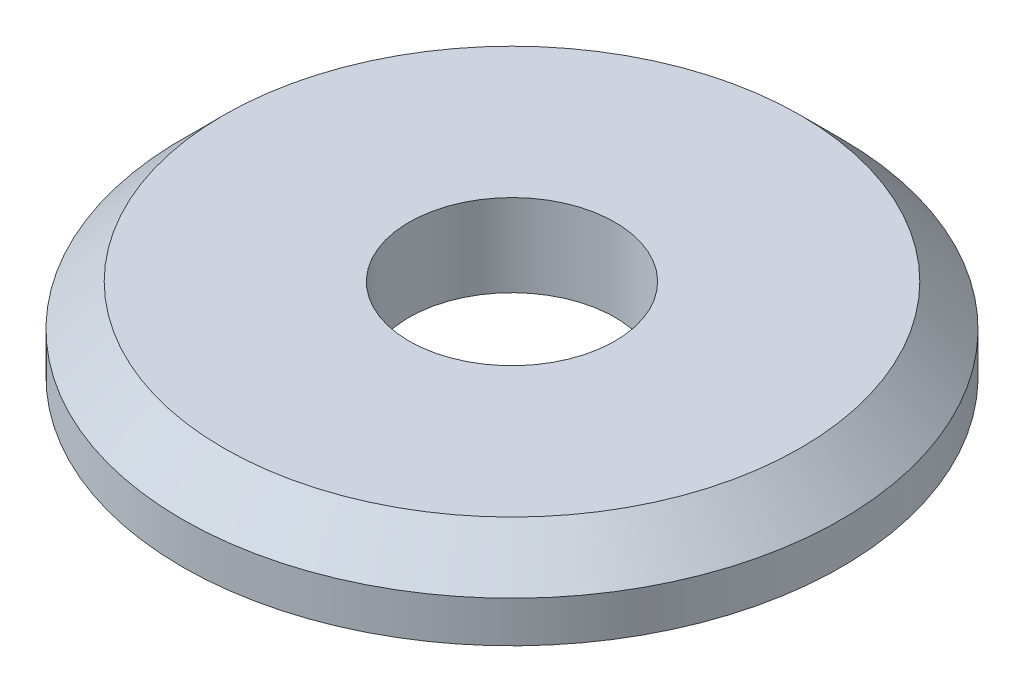
ISO-10303-21;
HEADER;
FILE_DESCRIPTION(('STEP AP214'),'2;1');
FILE_NAME('part.step','',(''),(''),'','','');
FILE_SCHEMA(('AUTOMOTIVE_DESIGN { 1 0 10303 214 1 1 1 1 }'));
ENDSEC;
DATA;
#1=APPLICATION_CONTEXT('core data for automotive mechanical design processes');
#2=APPLICATION_PROTOCOL_DEFINITION('international standard','automotive_design',2000,#1);
#3=PRODUCT_CONTEXT('',#1,'mechanical');
#4=PRODUCT('Part','Part','',(#3));
#5=PRODUCT_RELATED_PRODUCT_CATEGORY('part','',(#4));
#6=PRODUCT_DEFINITION_FORMATION('','',#4);
#7=PRODUCT_DEFINITION_CONTEXT('part definition',#1,'design');
#8=PRODUCT_DEFINITION('design','',#6,#7);
#9=PRODUCT_DEFINITION_SHAPE('','',#8);
#10=(LENGTH_UNIT() NAMED_UNIT(*) SI_UNIT(.MILLI.,.METRE.));
#11=(NAMED_UNIT(*) PLANE_ANGLE_UNIT() SI_UNIT($,.RADIAN.));
#12=(NAMED_UNIT(*) SI_UNIT($,.STERADIAN.) SOLID_ANGLE_UNIT());
#13=UNCERTAINTY_MEASURE_WITH_UNIT(LENGTH_MEASURE(1.E-05),#10,'distance_accuracy_value','');
#14=(GEOMETRIC_REPRESENTATION_CONTEXT(3) GLOBAL_UNCERTAINTY_ASSIGNED_CONTEXT((#13)) GLOBAL_UNIT_ASSIGNED_CONTEXT((#10,
#11,#12)) REPRESENTATION_CONTEXT('',''));
#15=CARTESIAN_POINT('',(0.,0.,0.));
#16=DIRECTION('',(0.,0.,1.));
#17=DIRECTION('',(1.,0.,0.));
#18=AXIS2_PLACEMENT_3D('',#15,#16,#17);
#19=CARTESIAN_POINT('',(0.,2.,0.));
#20=DIRECTION('',(0.,-1.,0.));
#21=DIRECTION('',(0.,0.,-1.));
#22=AXIS2_PLACEMENT_3D('',#19,#20,#21);
#23=CYLINDRICAL_SURFACE('',#22,8.);
#24=CARTESIAN_POINT('',(0.,0.999999999999999,0.));
#25=DIRECTION('',(0.,1.,0.));
#26=DIRECTION('',(0.,0.,1.));
#27=AXIS2_PLACEMENT_3D('',#24,#25,#26);
#28=CIRCLE('',#27,8.);
#29=CARTESIAN_POINT('',(0.,0.999999999999999,8.));
#30=VERTEX_POINT('',#29);
#31=EDGE_CURVE('E10',#30,#30,#28,.F.);
#32=ORIENTED_EDGE('',*,*,#31,.T.);
#33=EDGE_LOOP('',(#32));
#34=FACE_BOUND('',#33,.T.);
#35=CARTESIAN_POINT('',(0.,0.,0.));
#36=DIRECTION('',(0.,1.,0.));
#37=DIRECTION('',(0.,0.,1.));
#38=AXIS2_PLACEMENT_3D('',#35,#36,#37);
#39=CIRCLE('',#38,8.);
#40=CARTESIAN_POINT('',(0.,0.,8.));
#41=VERTEX_POINT('',#40);
#42=EDGE_CURVE('E43',#41,#41,#39,.T.);
#43=ORIENTED_EDGE('',*,*,#42,.T.);
#44=EDGE_LOOP('',(#43));
#45=FACE_BOUND('',#44,.T.);
#46=ADVANCED_FACE('F32',(#34,#45),#23,.T.);
#47=CARTESIAN_POINT('',(0.,2.,0.));
#48=DIRECTION('',(0.,1.,0.));
#49=DIRECTION('',(0.,0.,1.));
#50=AXIS2_PLACEMENT_3D('',#47,#48,#49);
#51=PLANE('',#50);
#52=CARTESIAN_POINT('',(0.,2.,0.));
#53=DIRECTION('',(0.,1.,0.));
#54=DIRECTION('',(0.,0.,1.));
#55=AXIS2_PLACEMENT_3D('',#52,#53,#54);
#56=CIRCLE('',#55,2.5);
#57=CARTESIAN_POINT('',(0.,2.,2.5));
#58=VERTEX_POINT('',#57);
#59=EDGE_CURVE('E50',#58,#58,#56,.T.);
#60=ORIENTED_EDGE('',*,*,#59,.F.);
#61=EDGE_LOOP('',(#60));
#62=FACE_BOUND('',#61,.T.);
#63=CARTESIAN_POINT('',(0.,2.,0.));
#64=DIRECTION('',(0.,1.,0.));
#65=DIRECTION('',(0.,0.,1.));
#66=AXIS2_PLACEMENT_3D('',#63,#64,#65);
#67=CIRCLE('',#66,7.);
#68=CARTESIAN_POINT('',(0.,2.,7.));
#69=VERTEX_POINT('',#68);
#70=EDGE_CURVE('E39',#69,#69,#67,.T.);
#71=ORIENTED_EDGE('',*,*,#70,.T.);
#72=EDGE_LOOP('',(#71));
#73=FACE_BOUND('',#72,.T.);
#74=ADVANCED_FACE('F65',(#62,#73),#51,.T.);
#75=CARTESIAN_POINT('',(0.,0.,0.));
#76=DIRECTION('',(0.,1.,0.));
#77=DIRECTION('',(0.,0.,1.));
#78=AXIS2_PLACEMENT_3D('',#75,#76,#77);
#79=PLANE('',#78);
#80=CARTESIAN_POINT('',(0.,0.,0.));
#81=DIRECTION('',(0.,1.,0.));
#82=DIRECTION('',(0.,0.,1.));
#83=AXIS2_PLACEMENT_3D('',#80,#81,#82);
#84=CIRCLE('',#83,2.5);
#85=CARTESIAN_POINT('',(0.,0.,2.5));
#86=VERTEX_POINT('',#85);
#87=EDGE_CURVE('E47',#86,#86,#84,.T.);
#88=ORIENTED_EDGE('',*,*,#87,.T.);
#89=EDGE_LOOP('',(#88));
#90=FACE_BOUND('',#89,.T.);
#91=ORIENTED_EDGE('',*,*,#42,.F.);
#92=EDGE_LOOP('',(#91));
#93=FACE_BOUND('',#92,.T.);
#94=ADVANCED_FACE('F56',(#90,#93),#79,.F.);
#95=CARTESIAN_POINT('',(0.,2.,0.));
#96=DIRECTION('',(0.,-1.,0.));
#97=DIRECTION('',(0.,0.,-1.));
#98=AXIS2_PLACEMENT_3D('',#95,#96,#97);
#99=CONICAL_SURFACE('',#98,7.,0.785398163397447);
#100=ORIENTED_EDGE('',*,*,#31,.F.);
#101=EDGE_LOOP('',(#100));
#102=FACE_BOUND('',#101,.T.);
#103=ORIENTED_EDGE('',*,*,#70,.F.);
#104=EDGE_LOOP('',(#103));
#105=FACE_BOUND('',#104,.T.);
#106=ADVANCED_FACE('F34',(#102,#105),#99,.T.);
#107=CARTESIAN_POINT('',(0.,0.,0.));
#108=DIRECTION('',(0.,1.,0.));
#109=DIRECTION('',(0.,0.,1.));
#110=AXIS2_PLACEMENT_3D('',#107,#108,#109);
#111=CYLINDRICAL_SURFACE('',#110,2.5);
#112=ORIENTED_EDGE('',*,*,#87,.F.);
#113=EDGE_LOOP('',(#112));
#114=FACE_BOUND('',#113,.T.);
#115=ORIENTED_EDGE('',*,*,#59,.T.);
#116=EDGE_LOOP('',(#115));
#117=FACE_BOUND('',#116,.T.);
#118=ADVANCED_FACE('F59',(#114,#117),#111,.F.);
#119=CLOSED_SHELL('',(#46,#74,#94,#106,#118));
#120=MANIFOLD_SOLID_BREP('B2',#119);
#121=ADVANCED_BREP_SHAPE_REPRESENTATION('',(#18,#120),#14);
#122=SHAPE_DEFINITION_REPRESENTATION(#9,#121);
ENDSEC;
END-ISO-10303-21;
